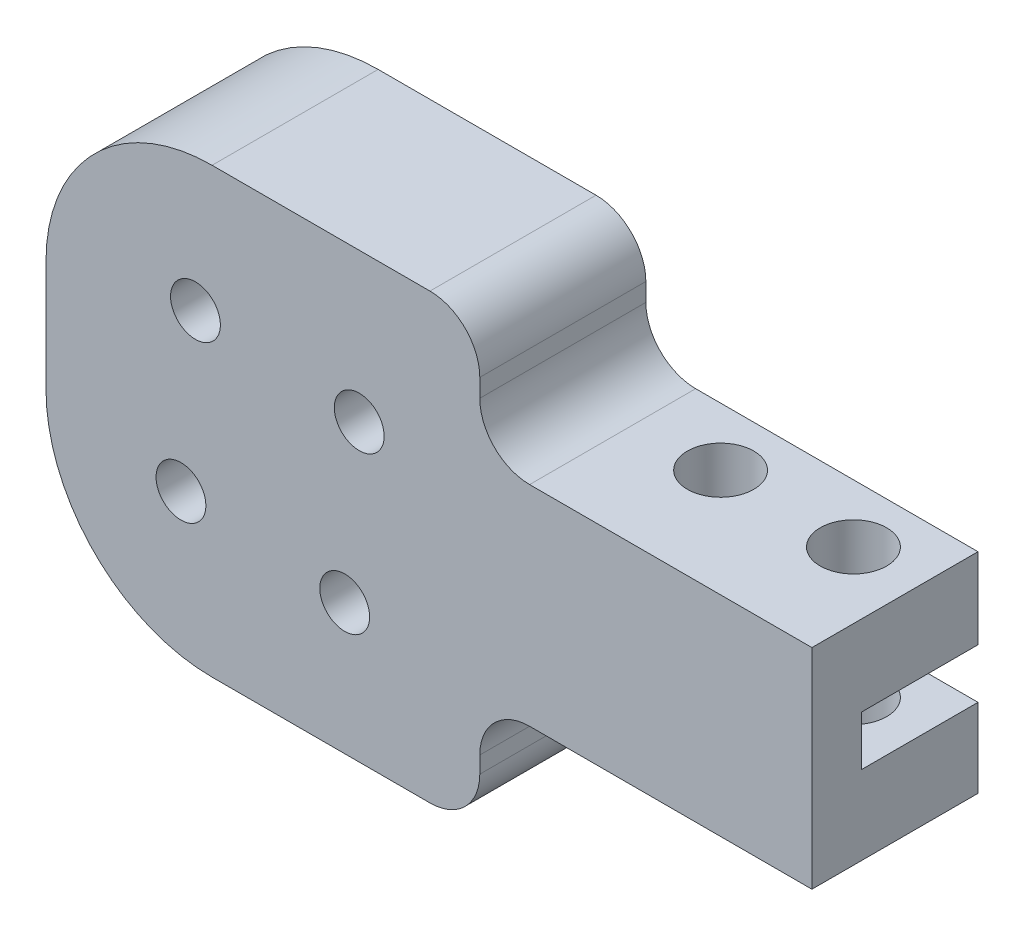
ISO-10303-21;
HEADER;
FILE_DESCRIPTION(('STEP AP214'),'2;1');
FILE_NAME('part.step','',(''),(''),'','','');
FILE_SCHEMA(('AUTOMOTIVE_DESIGN { 1 0 10303 214 1 1 1 1 }'));
ENDSEC;
DATA;
#1=APPLICATION_CONTEXT('core data for automotive mechanical design processes');
#2=APPLICATION_PROTOCOL_DEFINITION('international standard','automotive_design',2000,#1);
#3=PRODUCT_CONTEXT('',#1,'mechanical');
#4=PRODUCT('Part','Part','',(#3));
#5=PRODUCT_RELATED_PRODUCT_CATEGORY('part','',(#4));
#6=PRODUCT_DEFINITION_FORMATION('','',#4);
#7=PRODUCT_DEFINITION_CONTEXT('part definition',#1,'design');
#8=PRODUCT_DEFINITION('design','',#6,#7);
#9=PRODUCT_DEFINITION_SHAPE('','',#8);
#10=(LENGTH_UNIT() NAMED_UNIT(*) SI_UNIT(.MILLI.,.METRE.));
#11=(NAMED_UNIT(*) PLANE_ANGLE_UNIT() SI_UNIT($,.RADIAN.));
#12=(NAMED_UNIT(*) SI_UNIT($,.STERADIAN.) SOLID_ANGLE_UNIT());
#13=UNCERTAINTY_MEASURE_WITH_UNIT(LENGTH_MEASURE(1.E-05),#10,'distance_accuracy_value','');
#14=(GEOMETRIC_REPRESENTATION_CONTEXT(3) GLOBAL_UNCERTAINTY_ASSIGNED_CONTEXT((#13)) GLOBAL_UNIT_ASSIGNED_CONTEXT((#10,
#11,#12)) REPRESENTATION_CONTEXT('',''));
#15=CARTESIAN_POINT('',(0.,0.,0.));
#16=DIRECTION('',(0.,0.,1.));
#17=DIRECTION('',(1.,0.,0.));
#18=AXIS2_PLACEMENT_3D('',#15,#16,#17);
#19=CARTESIAN_POINT('',(-18.393953773828,17.863079719373,10.));
#20=DIRECTION('',(0.,0.,1.));
#21=DIRECTION('',(1.,0.,0.));
#22=AXIS2_PLACEMENT_3D('',#19,#20,#21);
#23=PLANE('',#22);
#24=DIRECTION('',(0.,1.,0.));
#25=VECTOR('',#24,1.);
#26=CARTESIAN_POINT('',(-5.76742802912065,31.308600149238,10.));
#27=LINE('',#26,#25);
#28=CARTESIAN_POINT('',(-5.76742802912065,27.2181452100799,10.));
#29=VERTEX_POINT('',#28);
#30=CARTESIAN_POINT('',(-5.76742802912065,28.308600149238,10.));
#31=VERTEX_POINT('',#30);
#32=EDGE_CURVE('E173',#29,#31,#27,.T.);
#33=ORIENTED_EDGE('',*,*,#32,.T.);
#34=CARTESIAN_POINT('',(-8.76742802912065,28.308600149238,10.));
#35=DIRECTION('',(0.,0.,1.));
#36=DIRECTION('',(1.,0.,0.));
#37=AXIS2_PLACEMENT_3D('',#34,#35,#36);
#38=CIRCLE('',#37,3.);
#39=CARTESIAN_POINT('',(-8.76742802912065,31.308600149238,10.));
#40=VERTEX_POINT('',#39);
#41=EDGE_CURVE('E59',#31,#40,#38,.T.);
#42=ORIENTED_EDGE('',*,*,#41,.T.);
#43=DIRECTION('',(-1.,0.,0.));
#44=VECTOR('',#43,1.);
#45=CARTESIAN_POINT('',(31.8143135194191,31.308600149238,10.));
#46=LINE('',#45,#44);
#47=CARTESIAN_POINT('',(-21.8876521447464,31.308600149238,10.));
#48=VERTEX_POINT('',#47);
#49=EDGE_CURVE('E213',#40,#48,#46,.T.);
#50=ORIENTED_EDGE('',*,*,#49,.T.);
#51=CARTESIAN_POINT('',(-21.8876521447464,21.308600149238,10.));
#52=DIRECTION('',(0.,0.,1.));
#53=DIRECTION('',(1.,0.,0.));
#54=AXIS2_PLACEMENT_3D('',#51,#52,#53);
#55=CIRCLE('',#54,10.);
#56=CARTESIAN_POINT('',(-31.8876521447464,21.308600149238,10.));
#57=VERTEX_POINT('',#56);
#58=EDGE_CURVE('E245',#48,#57,#55,.T.);
#59=ORIENTED_EDGE('',*,*,#58,.T.);
#60=DIRECTION('',(0.,-1.,0.));
#61=VECTOR('',#60,1.);
#62=CARTESIAN_POINT('',(-31.8876521447464,-32.0234769643548,10.));
#63=LINE('',#62,#61);
#64=CARTESIAN_POINT('',(-31.8876521447464,14.6152842401668,10.));
#65=VERTEX_POINT('',#64);
#66=EDGE_CURVE('E210',#57,#65,#63,.T.);
#67=ORIENTED_EDGE('',*,*,#66,.T.);
#68=CARTESIAN_POINT('',(-21.8876521447464,14.6152842401668,10.));
#69=DIRECTION('',(0.,0.,1.));
#70=DIRECTION('',(1.,0.,0.));
#71=AXIS2_PLACEMENT_3D('',#68,#69,#70);
#72=CIRCLE('',#71,10.);
#73=CARTESIAN_POINT('',(-21.8876521447464,4.61528424016677,10.));
#74=VERTEX_POINT('',#73);
#75=EDGE_CURVE('E243',#65,#74,#72,.T.);
#76=ORIENTED_EDGE('',*,*,#75,.T.);
#77=DIRECTION('',(1.,0.,0.));
#78=VECTOR('',#77,1.);
#79=CARTESIAN_POINT('',(-41.6050737450036,4.61528424016678,10.));
#80=LINE('',#79,#78);
#81=CARTESIAN_POINT('',(-8.76742802912066,4.61528424016677,10.));
#82=VERTEX_POINT('',#81);
#83=EDGE_CURVE('E204',#74,#82,#80,.T.);
#84=ORIENTED_EDGE('',*,*,#83,.T.);
#85=CARTESIAN_POINT('',(-8.76742802912065,7.61528424016677,10.));
#86=DIRECTION('',(0.,0.,1.));
#87=DIRECTION('',(1.,0.,0.));
#88=AXIS2_PLACEMENT_3D('',#85,#86,#87);
#89=CIRCLE('',#88,3.);
#90=CARTESIAN_POINT('',(-5.76742802912065,7.61528424016677,10.));
#91=VERTEX_POINT('',#90);
#92=EDGE_CURVE('E267',#82,#91,#89,.T.);
#93=ORIENTED_EDGE('',*,*,#92,.T.);
#94=DIRECTION('',(0.,1.,0.));
#95=VECTOR('',#94,1.);
#96=CARTESIAN_POINT('',(-5.76742802912065,4.61528424016677,10.));
#97=LINE('',#96,#95);
#98=CARTESIAN_POINT('',(-5.76742802912065,8.61528424016676,10.));
#99=VERTEX_POINT('',#98);
#100=EDGE_CURVE('E329',#91,#99,#97,.T.);
#101=ORIENTED_EDGE('',*,*,#100,.T.);
#102=CARTESIAN_POINT('',(-2.76742802912065,8.61528424016677,10.));
#103=DIRECTION('',(0.,0.,1.));
#104=DIRECTION('',(1.,0.,0.));
#105=AXIS2_PLACEMENT_3D('',#102,#103,#104);
#106=CIRCLE('',#105,3.);
#107=CARTESIAN_POINT('',(-2.76742802912065,11.6152842401668,10.));
#108=VERTEX_POINT('',#107);
#109=EDGE_CURVE('E274',#99,#108,#106,.F.);
#110=ORIENTED_EDGE('',*,*,#109,.T.);
#111=DIRECTION('',(1.,0.,0.));
#112=VECTOR('',#111,1.);
#113=CARTESIAN_POINT('',(14.2325719708793,11.6152842401668,10.));
#114=LINE('',#113,#112);
#115=CARTESIAN_POINT('',(14.2325719708793,11.6152842401668,10.));
#116=VERTEX_POINT('',#115);
#117=EDGE_CURVE('E332',#108,#116,#114,.T.);
#118=ORIENTED_EDGE('',*,*,#117,.T.);
#119=DIRECTION('',(0.,-1.,0.));
#120=VECTOR('',#119,1.);
#121=CARTESIAN_POINT('',(14.2325719708794,40.0528054621105,10.));
#122=LINE('',#121,#120);
#123=CARTESIAN_POINT('',(14.2325719708794,24.2181452100799,10.));
#124=VERTEX_POINT('',#123);
#125=EDGE_CURVE('E189',#124,#116,#122,.T.);
#126=ORIENTED_EDGE('',*,*,#125,.F.);
#127=DIRECTION('',(-1.,0.,0.));
#128=VECTOR('',#127,1.);
#129=CARTESIAN_POINT('',(14.2325719708793,24.2181452100799,10.));
#130=LINE('',#129,#128);
#131=CARTESIAN_POINT('',(-2.76742802912065,24.2181452100799,10.));
#132=VERTEX_POINT('',#131);
#133=EDGE_CURVE('E168',#124,#132,#130,.T.);
#134=ORIENTED_EDGE('',*,*,#133,.T.);
#135=CARTESIAN_POINT('',(-2.76742802912065,27.2181452100799,10.));
#136=DIRECTION('',(0.,0.,1.));
#137=DIRECTION('',(1.,0.,0.));
#138=AXIS2_PLACEMENT_3D('',#135,#136,#137);
#139=CIRCLE('',#138,3.);
#140=EDGE_CURVE('E11',#132,#29,#139,.F.);
#141=ORIENTED_EDGE('',*,*,#140,.T.);
#142=EDGE_LOOP('',(#33,#42,#50,#59,#67,#76,#84,#93,#101,#110,#118,#126,#134,#141));
#143=FACE_BOUND('',#142,.T.);
#144=CARTESIAN_POINT('',(-23.7611387856573,13.3693813484546,10.));
#145=DIRECTION('',(0.,0.,1.));
#146=DIRECTION('',(1.,0.,0.));
#147=AXIS2_PLACEMENT_3D('',#144,#145,#146);
#148=CIRCLE('',#147,1.5);
#149=CARTESIAN_POINT('',(-22.2611387856573,13.3693813484546,10.));
#150=VERTEX_POINT('',#149);
#151=EDGE_CURVE('E313',#150,#150,#148,.T.);
#152=ORIENTED_EDGE('',*,*,#151,.F.);
#153=EDGE_LOOP('',(#152));
#154=FACE_BOUND('',#153,.T.);
#155=CARTESIAN_POINT('',(-13.9002554029095,12.4958947075437,10.));
#156=DIRECTION('',(0.,0.,1.));
#157=DIRECTION('',(1.,0.,0.));
#158=AXIS2_PLACEMENT_3D('',#155,#156,#157);
#159=CIRCLE('',#158,1.5);
#160=CARTESIAN_POINT('',(-12.4002554029095,12.4958947075437,10.));
#161=VERTEX_POINT('',#160);
#162=EDGE_CURVE('E319',#161,#161,#159,.T.);
#163=ORIENTED_EDGE('',*,*,#162,.F.);
#164=EDGE_LOOP('',(#163));
#165=FACE_BOUND('',#164,.T.);
#166=CARTESIAN_POINT('',(-13.0267687619987,22.3567780902914,10.));
#167=DIRECTION('',(0.,0.,1.));
#168=DIRECTION('',(1.,0.,0.));
#169=AXIS2_PLACEMENT_3D('',#166,#167,#168);
#170=CIRCLE('',#169,1.5);
#171=CARTESIAN_POINT('',(-11.5267687619987,22.3567780902914,10.));
#172=VERTEX_POINT('',#171);
#173=EDGE_CURVE('E325',#172,#172,#170,.T.);
#174=ORIENTED_EDGE('',*,*,#173,.F.);
#175=EDGE_LOOP('',(#174));
#176=FACE_BOUND('',#175,.T.);
#177=CARTESIAN_POINT('',(-22.8876521447464,23.2302647312023,10.));
#178=DIRECTION('',(0.,0.,1.));
#179=DIRECTION('',(1.,0.,0.));
#180=AXIS2_PLACEMENT_3D('',#177,#178,#179);
#181=CIRCLE('',#180,1.5);
#182=CARTESIAN_POINT('',(-21.3876521447464,23.2302647312023,10.));
#183=VERTEX_POINT('',#182);
#184=EDGE_CURVE('E194',#183,#183,#181,.T.);
#185=ORIENTED_EDGE('',*,*,#184,.F.);
#186=EDGE_LOOP('',(#185));
#187=FACE_BOUND('',#186,.T.);
#188=ADVANCED_FACE('F34',(#143,#154,#165,#176,#187),#23,.T.);
#189=CARTESIAN_POINT('',(-18.393953773828,17.863079719373,0.));
#190=DIRECTION('',(0.,0.,1.));
#191=DIRECTION('',(1.,0.,0.));
#192=AXIS2_PLACEMENT_3D('',#189,#190,#191);
#193=PLANE('',#192);
#194=DIRECTION('',(1.,0.,0.));
#195=VECTOR('',#194,1.);
#196=CARTESIAN_POINT('',(-18.393953773828,31.308600149238,0.));
#197=LINE('',#196,#195);
#198=CARTESIAN_POINT('',(-21.8876521447464,31.308600149238,0.));
#199=VERTEX_POINT('',#198);
#200=CARTESIAN_POINT('',(-8.76742802912065,31.308600149238,0.));
#201=VERTEX_POINT('',#200);
#202=EDGE_CURVE('E236',#199,#201,#197,.T.);
#203=ORIENTED_EDGE('',*,*,#202,.T.);
#204=CARTESIAN_POINT('',(-8.76742802912065,28.308600149238,0.));
#205=DIRECTION('',(0.,0.,1.));
#206=DIRECTION('',(1.,0.,0.));
#207=AXIS2_PLACEMENT_3D('',#204,#205,#206);
#208=CIRCLE('',#207,3.);
#209=CARTESIAN_POINT('',(-5.76742802912065,28.308600149238,0.));
#210=VERTEX_POINT('',#209);
#211=EDGE_CURVE('E51',#201,#210,#208,.F.);
#212=ORIENTED_EDGE('',*,*,#211,.T.);
#213=DIRECTION('',(0.,1.,0.));
#214=VECTOR('',#213,1.);
#215=CARTESIAN_POINT('',(-5.76742802912065,31.308600149238,0.));
#216=LINE('',#215,#214);
#217=CARTESIAN_POINT('',(-5.76742802912065,27.2181452100799,0.));
#218=VERTEX_POINT('',#217);
#219=EDGE_CURVE('E182',#218,#210,#216,.T.);
#220=ORIENTED_EDGE('',*,*,#219,.F.);
#221=CARTESIAN_POINT('',(-2.76742802912065,27.2181452100799,0.));
#222=DIRECTION('',(0.,0.,1.));
#223=DIRECTION('',(1.,0.,0.));
#224=AXIS2_PLACEMENT_3D('',#221,#222,#223);
#225=CIRCLE('',#224,3.);
#226=CARTESIAN_POINT('',(-2.76742802912065,24.2181452100799,0.));
#227=VERTEX_POINT('',#226);
#228=EDGE_CURVE('E43',#218,#227,#225,.T.);
#229=ORIENTED_EDGE('',*,*,#228,.T.);
#230=DIRECTION('',(-1.,0.,0.));
#231=VECTOR('',#230,1.);
#232=CARTESIAN_POINT('',(14.2325719708793,24.2181452100799,0.));
#233=LINE('',#232,#231);
#234=CARTESIAN_POINT('',(14.2325719708793,24.2181452100799,0.));
#235=VERTEX_POINT('',#234);
#236=EDGE_CURVE('E165',#235,#227,#233,.T.);
#237=ORIENTED_EDGE('',*,*,#236,.F.);
#238=DIRECTION('',(0.,-1.,0.));
#239=VECTOR('',#238,1.);
#240=CARTESIAN_POINT('',(14.2325719708794,40.0528054621105,0.));
#241=LINE('',#240,#239);
#242=CARTESIAN_POINT('',(14.2325719708793,19.363079719373,0.));
#243=VERTEX_POINT('',#242);
#244=EDGE_CURVE('E179',#235,#243,#241,.T.);
#245=ORIENTED_EDGE('',*,*,#244,.T.);
#246=DIRECTION('',(1.,0.,0.));
#247=VECTOR('',#246,1.);
#248=CARTESIAN_POINT('',(-13.665602101554,19.363079719373,0.));
#249=LINE('',#248,#247);
#250=CARTESIAN_POINT('',(-8.50709380718538,19.363079719373,0.));
#251=VERTEX_POINT('',#250);
#252=EDGE_CURVE('E217',#251,#243,#249,.T.);
#253=ORIENTED_EDGE('',*,*,#252,.F.);
#254=CARTESIAN_POINT('',(-18.393953773828,17.863079719373,0.));
#255=DIRECTION('',(0.,0.,-1.));
#256=DIRECTION('',(-1.,0.,0.));
#257=AXIS2_PLACEMENT_3D('',#254,#255,#256);
#258=CIRCLE('',#257,10.);
#259=CARTESIAN_POINT('',(-8.50709380718537,16.363079719373,0.));
#260=VERTEX_POINT('',#259);
#261=EDGE_CURVE('E232',#260,#251,#258,.T.);
#262=ORIENTED_EDGE('',*,*,#261,.F.);
#263=DIRECTION('',(-1.,0.,0.));
#264=VECTOR('',#263,1.);
#265=CARTESIAN_POINT('',(-13.665602101554,16.363079719373,0.));
#266=LINE('',#265,#264);
#267=CARTESIAN_POINT('',(14.2325719708793,16.363079719373,0.));
#268=VERTEX_POINT('',#267);
#269=EDGE_CURVE('E222',#268,#260,#266,.T.);
#270=ORIENTED_EDGE('',*,*,#269,.F.);
#271=CARTESIAN_POINT('',(14.2325719708793,11.6152842401668,0.));
#272=VERTEX_POINT('',#271);
#273=EDGE_CURVE('E190',#268,#272,#241,.T.);
#274=ORIENTED_EDGE('',*,*,#273,.T.);
#275=DIRECTION('',(1.,0.,0.));
#276=VECTOR('',#275,1.);
#277=CARTESIAN_POINT('',(14.2325719708793,11.6152842401668,0.));
#278=LINE('',#277,#276);
#279=CARTESIAN_POINT('',(-2.76742802912065,11.6152842401668,0.));
#280=VERTEX_POINT('',#279);
#281=EDGE_CURVE('E333',#280,#272,#278,.T.);
#282=ORIENTED_EDGE('',*,*,#281,.F.);
#283=CARTESIAN_POINT('',(-2.76742802912065,8.61528424016677,0.));
#284=DIRECTION('',(0.,0.,1.));
#285=DIRECTION('',(1.,0.,0.));
#286=AXIS2_PLACEMENT_3D('',#283,#284,#285);
#287=CIRCLE('',#286,3.);
#288=CARTESIAN_POINT('',(-5.76742802912065,8.61528424016676,0.));
#289=VERTEX_POINT('',#288);
#290=EDGE_CURVE('E272',#280,#289,#287,.T.);
#291=ORIENTED_EDGE('',*,*,#290,.T.);
#292=DIRECTION('',(0.,1.,0.));
#293=VECTOR('',#292,1.);
#294=CARTESIAN_POINT('',(-5.76742802912065,4.61528424016677,0.));
#295=LINE('',#294,#293);
#296=CARTESIAN_POINT('',(-5.76742802912065,7.61528424016677,0.));
#297=VERTEX_POINT('',#296);
#298=EDGE_CURVE('E328',#297,#289,#295,.T.);
#299=ORIENTED_EDGE('',*,*,#298,.F.);
#300=CARTESIAN_POINT('',(-8.76742802912065,7.61528424016677,0.));
#301=DIRECTION('',(0.,0.,1.));
#302=DIRECTION('',(1.,0.,0.));
#303=AXIS2_PLACEMENT_3D('',#300,#301,#302);
#304=CIRCLE('',#303,3.);
#305=CARTESIAN_POINT('',(-8.76742802912066,4.61528424016677,0.));
#306=VERTEX_POINT('',#305);
#307=EDGE_CURVE('E263',#297,#306,#304,.F.);
#308=ORIENTED_EDGE('',*,*,#307,.T.);
#309=DIRECTION('',(1.,0.,0.));
#310=VECTOR('',#309,1.);
#311=CARTESIAN_POINT('',(-41.6050737450036,4.61528424016678,0.));
#312=LINE('',#311,#310);
#313=CARTESIAN_POINT('',(-21.8876521447464,4.61528424016677,0.));
#314=VERTEX_POINT('',#313);
#315=EDGE_CURVE('E203',#314,#306,#312,.T.);
#316=ORIENTED_EDGE('',*,*,#315,.F.);
#317=CARTESIAN_POINT('',(-21.8876521447464,14.6152842401668,0.));
#318=DIRECTION('',(0.,0.,1.));
#319=DIRECTION('',(1.,0.,0.));
#320=AXIS2_PLACEMENT_3D('',#317,#318,#319);
#321=CIRCLE('',#320,10.);
#322=CARTESIAN_POINT('',(-31.8876521447464,14.6152842401668,0.));
#323=VERTEX_POINT('',#322);
#324=EDGE_CURVE('E252',#314,#323,#321,.F.);
#325=ORIENTED_EDGE('',*,*,#324,.T.);
#326=DIRECTION('',(0.,-1.,0.));
#327=VECTOR('',#326,1.);
#328=CARTESIAN_POINT('',(-31.8876521447464,-32.0234769643548,0.));
#329=LINE('',#328,#327);
#330=CARTESIAN_POINT('',(-31.8876521447464,21.308600149238,0.));
#331=VERTEX_POINT('',#330);
#332=EDGE_CURVE('E207',#331,#323,#329,.T.);
#333=ORIENTED_EDGE('',*,*,#332,.F.);
#334=CARTESIAN_POINT('',(-21.8876521447464,21.308600149238,0.));
#335=DIRECTION('',(0.,0.,1.));
#336=DIRECTION('',(1.,0.,0.));
#337=AXIS2_PLACEMENT_3D('',#334,#335,#336);
#338=CIRCLE('',#337,10.);
#339=EDGE_CURVE('E254',#331,#199,#338,.F.);
#340=ORIENTED_EDGE('',*,*,#339,.T.);
#341=EDGE_LOOP('',(#203,#212,#220,#229,#237,#245,#253,#262,#270,#274,#282,#291,#299,#308,#316,
#325,#333,#340));
#342=FACE_BOUND('',#341,.T.);
#343=ADVANCED_FACE('F177',(#342),#193,.F.);
#344=CARTESIAN_POINT('',(-18.393953773828,17.863079719373,7.));
#345=DIRECTION('',(0.,0.,-1.));
#346=DIRECTION('',(-1.,0.,0.));
#347=AXIS2_PLACEMENT_3D('',#344,#345,#346);
#348=PLANE('',#347);
#349=CARTESIAN_POINT('',(-23.7611387856573,13.3693813484546,7.));
#350=DIRECTION('',(0.,0.,-1.));
#351=DIRECTION('',(0.,-1.,0.));
#352=AXIS2_PLACEMENT_3D('',#349,#350,#351);
#353=CIRCLE('',#352,1.5);
#354=CARTESIAN_POINT('',(-23.7611387856573,11.8693813484546,7.));
#355=VERTEX_POINT('',#354);
#356=EDGE_CURVE('E172',#355,#355,#353,.T.);
#357=ORIENTED_EDGE('',*,*,#356,.F.);
#358=EDGE_LOOP('',(#357));
#359=FACE_BOUND('',#358,.T.);
#360=CARTESIAN_POINT('',(-13.9002554029095,12.4958947075437,7.));
#361=DIRECTION('',(0.,0.,-1.));
#362=DIRECTION('',(1.,0.,0.));
#363=AXIS2_PLACEMENT_3D('',#360,#361,#362);
#364=CIRCLE('',#363,1.5);
#365=CARTESIAN_POINT('',(-12.4002554029095,12.4958947075437,7.));
#366=VERTEX_POINT('',#365);
#367=EDGE_CURVE('E316',#366,#366,#364,.T.);
#368=ORIENTED_EDGE('',*,*,#367,.F.);
#369=EDGE_LOOP('',(#368));
#370=FACE_BOUND('',#369,.T.);
#371=CARTESIAN_POINT('',(-13.0267687619987,22.3567780902914,7.));
#372=DIRECTION('',(0.,0.,-1.));
#373=DIRECTION('',(0.,1.,0.));
#374=AXIS2_PLACEMENT_3D('',#371,#372,#373);
#375=CIRCLE('',#374,1.5);
#376=CARTESIAN_POINT('',(-13.0267687619987,23.8567780902914,7.));
#377=VERTEX_POINT('',#376);
#378=EDGE_CURVE('E322',#377,#377,#375,.T.);
#379=ORIENTED_EDGE('',*,*,#378,.F.);
#380=EDGE_LOOP('',(#379));
#381=FACE_BOUND('',#380,.T.);
#382=CARTESIAN_POINT('',(-22.8876521447464,23.2302647312023,7.));
#383=DIRECTION('',(0.,0.,-1.));
#384=DIRECTION('',(-1.,0.,0.));
#385=AXIS2_PLACEMENT_3D('',#382,#383,#384);
#386=CIRCLE('',#385,1.5);
#387=CARTESIAN_POINT('',(-24.3876521447464,23.2302647312023,7.));
#388=VERTEX_POINT('',#387);
#389=EDGE_CURVE('E342',#388,#388,#386,.T.);
#390=ORIENTED_EDGE('',*,*,#389,.F.);
#391=EDGE_LOOP('',(#390));
#392=FACE_BOUND('',#391,.T.);
#393=DIRECTION('',(1.,0.,0.));
#394=VECTOR('',#393,1.);
#395=CARTESIAN_POINT('',(-13.665602101554,19.363079719373,7.));
#396=LINE('',#395,#394);
#397=CARTESIAN_POINT('',(-8.50709380718538,19.363079719373,7.));
#398=VERTEX_POINT('',#397);
#399=CARTESIAN_POINT('',(14.2325719708793,19.363079719373,7.));
#400=VERTEX_POINT('',#399);
#401=EDGE_CURVE('E218',#398,#400,#396,.T.);
#402=ORIENTED_EDGE('',*,*,#401,.T.);
#403=DIRECTION('',(0.,-1.,0.));
#404=VECTOR('',#403,1.);
#405=CARTESIAN_POINT('',(14.2325719708793,17.863079719373,7.));
#406=LINE('',#405,#404);
#407=CARTESIAN_POINT('',(14.2325719708793,16.363079719373,7.));
#408=VERTEX_POINT('',#407);
#409=EDGE_CURVE('E198',#400,#408,#406,.T.);
#410=ORIENTED_EDGE('',*,*,#409,.T.);
#411=DIRECTION('',(-1.,0.,0.));
#412=VECTOR('',#411,1.);
#413=CARTESIAN_POINT('',(-13.665602101554,16.363079719373,7.));
#414=LINE('',#413,#412);
#415=CARTESIAN_POINT('',(-8.50709380718537,16.363079719373,7.));
#416=VERTEX_POINT('',#415);
#417=EDGE_CURVE('E221',#408,#416,#414,.T.);
#418=ORIENTED_EDGE('',*,*,#417,.T.);
#419=CARTESIAN_POINT('',(-18.393953773828,17.863079719373,7.));
#420=DIRECTION('',(0.,0.,-1.));
#421=DIRECTION('',(-1.,0.,0.));
#422=AXIS2_PLACEMENT_3D('',#419,#420,#421);
#423=CIRCLE('',#422,10.);
#424=EDGE_CURVE('E233',#416,#398,#423,.T.);
#425=ORIENTED_EDGE('',*,*,#424,.T.);
#426=EDGE_LOOP('',(#402,#410,#418,#425));
#427=FACE_BOUND('',#426,.T.);
#428=ADVANCED_FACE('F355',(#359,#370,#381,#392,#427),#348,.T.);
#429=CARTESIAN_POINT('',(-13.665602101554,16.363079719373,7.));
#430=DIRECTION('',(0.,-1.,0.));
#431=DIRECTION('',(1.,0.,0.));
#432=AXIS2_PLACEMENT_3D('',#429,#430,#431);
#433=PLANE('',#432);
#434=CARTESIAN_POINT('',(2.23257197087935,16.363079719373,3.5));
#435=DIRECTION('',(0.,-1.,0.));
#436=DIRECTION('',(1.,0.,0.));
#437=AXIS2_PLACEMENT_3D('',#434,#435,#436);
#438=CIRCLE('',#437,2.);
#439=CARTESIAN_POINT('',(4.23257197087935,16.363079719373,3.5));
#440=VERTEX_POINT('',#439);
#441=EDGE_CURVE('E296',#440,#440,#438,.T.);
#442=ORIENTED_EDGE('',*,*,#441,.T.);
#443=EDGE_LOOP('',(#442));
#444=FACE_BOUND('',#443,.T.);
#445=CARTESIAN_POINT('',(10.2325719708793,16.363079719373,3.5));
#446=DIRECTION('',(0.,-1.,0.));
#447=DIRECTION('',(1.,0.,0.));
#448=AXIS2_PLACEMENT_3D('',#445,#446,#447);
#449=CIRCLE('',#448,2.);
#450=CARTESIAN_POINT('',(12.2325719708793,16.363079719373,3.5));
#451=VERTEX_POINT('',#450);
#452=EDGE_CURVE('E183',#451,#451,#449,.T.);
#453=ORIENTED_EDGE('',*,*,#452,.T.);
#454=EDGE_LOOP('',(#453));
#455=FACE_BOUND('',#454,.T.);
#456=DIRECTION('',(0.,0.,1.));
#457=VECTOR('',#456,1.);
#458=CARTESIAN_POINT('',(14.2325719708793,16.363079719373,7.));
#459=LINE('',#458,#457);
#460=EDGE_CURVE('E201',#268,#408,#459,.T.);
#461=ORIENTED_EDGE('',*,*,#460,.F.);
#462=ORIENTED_EDGE('',*,*,#269,.T.);
#463=DIRECTION('',(0.,0.,-1.));
#464=VECTOR('',#463,1.);
#465=CARTESIAN_POINT('',(-8.50709380718537,16.363079719373,7.));
#466=LINE('',#465,#464);
#467=EDGE_CURVE('E229',#416,#260,#466,.T.);
#468=ORIENTED_EDGE('',*,*,#467,.F.);
#469=ORIENTED_EDGE('',*,*,#417,.F.);
#470=EDGE_LOOP('',(#461,#462,#468,#469));
#471=FACE_BOUND('',#470,.T.);
#472=ADVANCED_FACE('F431',(#444,#455,#471),#433,.F.);
#473=CARTESIAN_POINT('',(-13.665602101554,19.363079719373,7.));
#474=DIRECTION('',(0.,1.,0.));
#475=DIRECTION('',(0.,0.,1.));
#476=AXIS2_PLACEMENT_3D('',#473,#474,#475);
#477=PLANE('',#476);
#478=CARTESIAN_POINT('',(2.23257197087935,19.363079719373,3.5));
#479=DIRECTION('',(0.,1.,0.));
#480=DIRECTION('',(0.,0.,1.));
#481=AXIS2_PLACEMENT_3D('',#478,#479,#480);
#482=CIRCLE('',#481,2.);
#483=CARTESIAN_POINT('',(2.23257197087935,19.363079719373,5.5));
#484=VERTEX_POINT('',#483);
#485=EDGE_CURVE('E301',#484,#484,#482,.T.);
#486=ORIENTED_EDGE('',*,*,#485,.T.);
#487=EDGE_LOOP('',(#486));
#488=FACE_BOUND('',#487,.T.);
#489=CARTESIAN_POINT('',(10.2325719708793,19.363079719373,3.5));
#490=DIRECTION('',(0.,1.,0.));
#491=DIRECTION('',(0.,0.,1.));
#492=AXIS2_PLACEMENT_3D('',#489,#490,#491);
#493=CIRCLE('',#492,2.);
#494=CARTESIAN_POINT('',(10.2325719708793,19.363079719373,5.5));
#495=VERTEX_POINT('',#494);
#496=EDGE_CURVE('E289',#495,#495,#493,.T.);
#497=ORIENTED_EDGE('',*,*,#496,.T.);
#498=EDGE_LOOP('',(#497));
#499=FACE_BOUND('',#498,.T.);
#500=DIRECTION('',(0.,0.,-1.));
#501=VECTOR('',#500,1.);
#502=CARTESIAN_POINT('',(14.2325719708793,19.363079719373,7.));
#503=LINE('',#502,#501);
#504=EDGE_CURVE('E187',#400,#243,#503,.T.);
#505=ORIENTED_EDGE('',*,*,#504,.F.);
#506=ORIENTED_EDGE('',*,*,#401,.F.);
#507=DIRECTION('',(0.,0.,-1.));
#508=VECTOR('',#507,1.);
#509=CARTESIAN_POINT('',(-8.50709380718538,19.363079719373,7.));
#510=LINE('',#509,#508);
#511=EDGE_CURVE('E224',#251,#398,#510,.F.);
#512=ORIENTED_EDGE('',*,*,#511,.F.);
#513=ORIENTED_EDGE('',*,*,#252,.T.);
#514=EDGE_LOOP('',(#505,#506,#512,#513));
#515=FACE_BOUND('',#514,.T.);
#516=ADVANCED_FACE('F437',(#488,#499,#515),#477,.F.);
#517=CARTESIAN_POINT('',(31.8143135194191,31.308600149238,10.));
#518=DIRECTION('',(0.,-1.,0.));
#519=DIRECTION('',(0.,0.,-1.));
#520=AXIS2_PLACEMENT_3D('',#517,#518,#519);
#521=PLANE('',#520);
#522=ORIENTED_EDGE('',*,*,#49,.F.);
#523=DIRECTION('',(0.,0.,-1.));
#524=VECTOR('',#523,1.);
#525=CARTESIAN_POINT('',(-8.76742802912065,31.308600149238,10.));
#526=LINE('',#525,#524);
#527=EDGE_CURVE('E283',#40,#201,#526,.T.);
#528=ORIENTED_EDGE('',*,*,#527,.T.);
#529=ORIENTED_EDGE('',*,*,#202,.F.);
#530=DIRECTION('',(0.,0.,1.));
#531=VECTOR('',#530,1.);
#532=CARTESIAN_POINT('',(-21.8876521447464,31.308600149238,10.));
#533=LINE('',#532,#531);
#534=EDGE_CURVE('E240',#199,#48,#533,.T.);
#535=ORIENTED_EDGE('',*,*,#534,.T.);
#536=EDGE_LOOP('',(#522,#528,#529,#535));
#537=FACE_BOUND('',#536,.T.);
#538=ADVANCED_FACE('F397',(#537),#521,.F.);
#539=CARTESIAN_POINT('',(-41.6050737450036,4.61528424016678,10.));
#540=DIRECTION('',(0.,1.,0.));
#541=DIRECTION('',(-1.,0.,0.));
#542=AXIS2_PLACEMENT_3D('',#539,#540,#541);
#543=PLANE('',#542);
#544=ORIENTED_EDGE('',*,*,#315,.T.);
#545=DIRECTION('',(0.,0.,-1.));
#546=VECTOR('',#545,1.);
#547=CARTESIAN_POINT('',(-8.76742802912066,4.61528424016677,10.));
#548=LINE('',#547,#546);
#549=EDGE_CURVE('E265',#306,#82,#548,.F.);
#550=ORIENTED_EDGE('',*,*,#549,.T.);
#551=ORIENTED_EDGE('',*,*,#83,.F.);
#552=DIRECTION('',(0.,0.,1.));
#553=VECTOR('',#552,1.);
#554=CARTESIAN_POINT('',(-21.8876521447464,4.61528424016677,10.));
#555=LINE('',#554,#553);
#556=EDGE_CURVE('E256',#74,#314,#555,.F.);
#557=ORIENTED_EDGE('',*,*,#556,.T.);
#558=EDGE_LOOP('',(#544,#550,#551,#557));
#559=FACE_BOUND('',#558,.T.);
#560=ADVANCED_FACE('F412',(#559),#543,.F.);
#561=CARTESIAN_POINT('',(-18.393953773828,17.863079719373,7.));
#562=DIRECTION('',(0.,0.,-1.));
#563=DIRECTION('',(-1.,0.,0.));
#564=AXIS2_PLACEMENT_3D('',#561,#562,#563);
#565=CYLINDRICAL_SURFACE('',#564,10.);
#566=ORIENTED_EDGE('',*,*,#424,.F.);
#567=ORIENTED_EDGE('',*,*,#467,.T.);
#568=ORIENTED_EDGE('',*,*,#261,.T.);
#569=ORIENTED_EDGE('',*,*,#511,.T.);
#570=EDGE_LOOP('',(#566,#567,#568,#569));
#571=FACE_BOUND('',#570,.T.);
#572=ADVANCED_FACE('F359',(#571),#565,.F.);
#573=CARTESIAN_POINT('',(-31.8876521447464,-32.0234769643548,10.));
#574=DIRECTION('',(1.,0.,0.));
#575=DIRECTION('',(0.,0.,-1.));
#576=AXIS2_PLACEMENT_3D('',#573,#574,#575);
#577=PLANE('',#576);
#578=ORIENTED_EDGE('',*,*,#66,.F.);
#579=DIRECTION('',(0.,0.,1.));
#580=VECTOR('',#579,1.);
#581=CARTESIAN_POINT('',(-31.8876521447464,21.308600149238,10.));
#582=LINE('',#581,#580);
#583=EDGE_CURVE('E250',#57,#331,#582,.F.);
#584=ORIENTED_EDGE('',*,*,#583,.T.);
#585=ORIENTED_EDGE('',*,*,#332,.T.);
#586=DIRECTION('',(0.,0.,1.));
#587=VECTOR('',#586,1.);
#588=CARTESIAN_POINT('',(-31.8876521447464,14.6152842401668,10.));
#589=LINE('',#588,#587);
#590=EDGE_CURVE('E247',#323,#65,#589,.T.);
#591=ORIENTED_EDGE('',*,*,#590,.T.);
#592=EDGE_LOOP('',(#578,#584,#585,#591));
#593=FACE_BOUND('',#592,.T.);
#594=ADVANCED_FACE('F405',(#593),#577,.F.);
#595=CARTESIAN_POINT('',(14.2325719708794,40.0528054621105,10.));
#596=DIRECTION('',(1.,0.,0.));
#597=DIRECTION('',(0.,1.,0.));
#598=AXIS2_PLACEMENT_3D('',#595,#596,#597);
#599=PLANE('',#598);
#600=DIRECTION('',(0.,0.,-1.));
#601=VECTOR('',#600,1.);
#602=CARTESIAN_POINT('',(14.2325719708793,24.2181452100799,10.));
#603=LINE('',#602,#601);
#604=EDGE_CURVE('E162',#124,#235,#603,.T.);
#605=ORIENTED_EDGE('',*,*,#604,.F.);
#606=ORIENTED_EDGE('',*,*,#125,.T.);
#607=DIRECTION('',(0.,0.,-1.));
#608=VECTOR('',#607,1.);
#609=CARTESIAN_POINT('',(14.2325719708793,11.6152842401668,10.));
#610=LINE('',#609,#608);
#611=EDGE_CURVE('E336',#116,#272,#610,.T.);
#612=ORIENTED_EDGE('',*,*,#611,.T.);
#613=ORIENTED_EDGE('',*,*,#273,.F.);
#614=ORIENTED_EDGE('',*,*,#460,.T.);
#615=ORIENTED_EDGE('',*,*,#409,.F.);
#616=ORIENTED_EDGE('',*,*,#504,.T.);
#617=ORIENTED_EDGE('',*,*,#244,.F.);
#618=EDGE_LOOP('',(#605,#606,#612,#613,#614,#615,#616,#617));
#619=FACE_BOUND('',#618,.T.);
#620=ADVANCED_FACE('F185',(#619),#599,.T.);
#621=CARTESIAN_POINT('',(-22.8876521447464,23.2302647312023,17.));
#622=DIRECTION('',(0.,0.,-1.));
#623=DIRECTION('',(-1.,0.,0.));
#624=AXIS2_PLACEMENT_3D('',#621,#622,#623);
#625=CYLINDRICAL_SURFACE('',#624,1.5);
#626=ORIENTED_EDGE('',*,*,#184,.T.);
#627=EDGE_LOOP('',(#626));
#628=FACE_BOUND('',#627,.T.);
#629=ORIENTED_EDGE('',*,*,#389,.T.);
#630=EDGE_LOOP('',(#629));
#631=FACE_BOUND('',#630,.T.);
#632=ADVANCED_FACE('F347',(#628,#631),#625,.F.);
#633=CARTESIAN_POINT('',(-21.8876521447464,21.308600149238,10.));
#634=DIRECTION('',(0.,0.,1.));
#635=DIRECTION('',(1.,0.,0.));
#636=AXIS2_PLACEMENT_3D('',#633,#634,#635);
#637=CYLINDRICAL_SURFACE('',#636,10.);
#638=ORIENTED_EDGE('',*,*,#339,.F.);
#639=ORIENTED_EDGE('',*,*,#583,.F.);
#640=ORIENTED_EDGE('',*,*,#58,.F.);
#641=ORIENTED_EDGE('',*,*,#534,.F.);
#642=EDGE_LOOP('',(#638,#639,#640,#641));
#643=FACE_BOUND('',#642,.T.);
#644=ADVANCED_FACE('F362',(#643),#637,.T.);
#645=CARTESIAN_POINT('',(-21.8876521447464,14.6152842401668,10.));
#646=DIRECTION('',(0.,0.,1.));
#647=DIRECTION('',(1.,0.,0.));
#648=AXIS2_PLACEMENT_3D('',#645,#646,#647);
#649=CYLINDRICAL_SURFACE('',#648,10.);
#650=ORIENTED_EDGE('',*,*,#324,.F.);
#651=ORIENTED_EDGE('',*,*,#556,.F.);
#652=ORIENTED_EDGE('',*,*,#75,.F.);
#653=ORIENTED_EDGE('',*,*,#590,.F.);
#654=EDGE_LOOP('',(#650,#651,#652,#653));
#655=FACE_BOUND('',#654,.T.);
#656=ADVANCED_FACE('F365',(#655),#649,.T.);
#657=CARTESIAN_POINT('',(14.2325719708793,11.6152842401668,10.));
#658=DIRECTION('',(0.,1.,0.));
#659=DIRECTION('',(0.,0.,1.));
#660=AXIS2_PLACEMENT_3D('',#657,#658,#659);
#661=PLANE('',#660);
#662=CARTESIAN_POINT('',(2.23257197087935,11.6152842401668,3.5));
#663=DIRECTION('',(0.,-1.,0.));
#664=DIRECTION('',(0.,0.,-1.));
#665=AXIS2_PLACEMENT_3D('',#662,#663,#664);
#666=CIRCLE('',#665,2.);
#667=CARTESIAN_POINT('',(2.23257197087935,11.6152842401668,1.5));
#668=VERTEX_POINT('',#667);
#669=EDGE_CURVE('E673',#668,#668,#666,.T.);
#670=ORIENTED_EDGE('',*,*,#669,.F.);
#671=EDGE_LOOP('',(#670));
#672=FACE_BOUND('',#671,.T.);
#673=CARTESIAN_POINT('',(10.2325719708793,11.6152842401668,3.5));
#674=DIRECTION('',(0.,-1.,0.));
#675=DIRECTION('',(0.,0.,-1.));
#676=AXIS2_PLACEMENT_3D('',#673,#674,#675);
#677=CIRCLE('',#676,2.);
#678=CARTESIAN_POINT('',(10.2325719708793,11.6152842401668,1.5));
#679=VERTEX_POINT('',#678);
#680=EDGE_CURVE('E290',#679,#679,#677,.T.);
#681=ORIENTED_EDGE('',*,*,#680,.F.);
#682=EDGE_LOOP('',(#681));
#683=FACE_BOUND('',#682,.T.);
#684=ORIENTED_EDGE('',*,*,#117,.F.);
#685=DIRECTION('',(0.,0.,-1.));
#686=VECTOR('',#685,1.);
#687=CARTESIAN_POINT('',(-2.76742802912065,11.6152842401668,0.));
#688=LINE('',#687,#686);
#689=EDGE_CURVE('E269',#108,#280,#688,.T.);
#690=ORIENTED_EDGE('',*,*,#689,.T.);
#691=ORIENTED_EDGE('',*,*,#281,.T.);
#692=ORIENTED_EDGE('',*,*,#611,.F.);
#693=EDGE_LOOP('',(#684,#690,#691,#692));
#694=FACE_BOUND('',#693,.T.);
#695=ADVANCED_FACE('F369',(#672,#683,#694),#661,.F.);
#696=CARTESIAN_POINT('',(-5.76742802912065,4.61528424016677,10.));
#697=DIRECTION('',(-1.,0.,0.));
#698=DIRECTION('',(0.,0.,1.));
#699=AXIS2_PLACEMENT_3D('',#696,#697,#698);
#700=PLANE('',#699);
#701=ORIENTED_EDGE('',*,*,#100,.F.);
#702=DIRECTION('',(0.,0.,-1.));
#703=VECTOR('',#702,1.);
#704=CARTESIAN_POINT('',(-5.76742802912065,7.61528424016677,10.));
#705=LINE('',#704,#703);
#706=EDGE_CURVE('E260',#91,#297,#705,.T.);
#707=ORIENTED_EDGE('',*,*,#706,.T.);
#708=ORIENTED_EDGE('',*,*,#298,.T.);
#709=DIRECTION('',(0.,0.,-1.));
#710=VECTOR('',#709,1.);
#711=CARTESIAN_POINT('',(-5.76742802912065,8.61528424016677,10.));
#712=LINE('',#711,#710);
#713=EDGE_CURVE('E258',#289,#99,#712,.F.);
#714=ORIENTED_EDGE('',*,*,#713,.T.);
#715=EDGE_LOOP('',(#701,#707,#708,#714));
#716=FACE_BOUND('',#715,.T.);
#717=ADVANCED_FACE('F375',(#716),#700,.F.);
#718=CARTESIAN_POINT('',(-8.76742802912065,7.61528424016677,10.));
#719=DIRECTION('',(0.,0.,-1.));
#720=DIRECTION('',(-1.,0.,0.));
#721=AXIS2_PLACEMENT_3D('',#718,#719,#720);
#722=CYLINDRICAL_SURFACE('',#721,3.);
#723=ORIENTED_EDGE('',*,*,#92,.F.);
#724=ORIENTED_EDGE('',*,*,#549,.F.);
#725=ORIENTED_EDGE('',*,*,#307,.F.);
#726=ORIENTED_EDGE('',*,*,#706,.F.);
#727=EDGE_LOOP('',(#723,#724,#725,#726));
#728=FACE_BOUND('',#727,.T.);
#729=ADVANCED_FACE('F371',(#728),#722,.T.);
#730=CARTESIAN_POINT('',(-2.76742802912065,8.61528424016677,10.));
#731=DIRECTION('',(0.,0.,1.));
#732=DIRECTION('',(1.,0.,0.));
#733=AXIS2_PLACEMENT_3D('',#730,#731,#732);
#734=CYLINDRICAL_SURFACE('',#733,3.);
#735=ORIENTED_EDGE('',*,*,#109,.F.);
#736=ORIENTED_EDGE('',*,*,#713,.F.);
#737=ORIENTED_EDGE('',*,*,#290,.F.);
#738=ORIENTED_EDGE('',*,*,#689,.F.);
#739=EDGE_LOOP('',(#735,#736,#737,#738));
#740=FACE_BOUND('',#739,.T.);
#741=ADVANCED_FACE('F374',(#740),#734,.F.);
#742=CARTESIAN_POINT('',(-13.0267687619987,22.3567780902914,17.));
#743=DIRECTION('',(0.,0.,-1.));
#744=DIRECTION('',(-1.,0.,0.));
#745=AXIS2_PLACEMENT_3D('',#742,#743,#744);
#746=CYLINDRICAL_SURFACE('',#745,1.5);
#747=ORIENTED_EDGE('',*,*,#173,.T.);
#748=EDGE_LOOP('',(#747));
#749=FACE_BOUND('',#748,.T.);
#750=ORIENTED_EDGE('',*,*,#378,.T.);
#751=EDGE_LOOP('',(#750));
#752=FACE_BOUND('',#751,.T.);
#753=ADVANCED_FACE('F378',(#749,#752),#746,.F.);
#754=CARTESIAN_POINT('',(-13.9002554029095,12.4958947075437,17.));
#755=DIRECTION('',(0.,0.,-1.));
#756=DIRECTION('',(-1.,0.,0.));
#757=AXIS2_PLACEMENT_3D('',#754,#755,#756);
#758=CYLINDRICAL_SURFACE('',#757,1.5);
#759=ORIENTED_EDGE('',*,*,#162,.T.);
#760=EDGE_LOOP('',(#759));
#761=FACE_BOUND('',#760,.T.);
#762=ORIENTED_EDGE('',*,*,#367,.T.);
#763=EDGE_LOOP('',(#762));
#764=FACE_BOUND('',#763,.T.);
#765=ADVANCED_FACE('F584',(#761,#764),#758,.F.);
#766=CARTESIAN_POINT('',(-23.7611387856573,13.3693813484546,17.));
#767=DIRECTION('',(0.,0.,-1.));
#768=DIRECTION('',(-1.,0.,0.));
#769=AXIS2_PLACEMENT_3D('',#766,#767,#768);
#770=CYLINDRICAL_SURFACE('',#769,1.5);
#771=ORIENTED_EDGE('',*,*,#151,.T.);
#772=EDGE_LOOP('',(#771));
#773=FACE_BOUND('',#772,.T.);
#774=ORIENTED_EDGE('',*,*,#356,.T.);
#775=EDGE_LOOP('',(#774));
#776=FACE_BOUND('',#775,.T.);
#777=ADVANCED_FACE('F500',(#773,#776),#770,.F.);
#778=CARTESIAN_POINT('',(-5.76742802912065,31.308600149238,10.));
#779=DIRECTION('',(-1.,0.,0.));
#780=DIRECTION('',(0.,-1.,0.));
#781=AXIS2_PLACEMENT_3D('',#778,#779,#780);
#782=PLANE('',#781);
#783=ORIENTED_EDGE('',*,*,#32,.F.);
#784=DIRECTION('',(0.,0.,-1.));
#785=VECTOR('',#784,1.);
#786=CARTESIAN_POINT('',(-5.76742802912065,27.2181452100799,0.));
#787=LINE('',#786,#785);
#788=EDGE_CURVE('E278',#29,#218,#787,.T.);
#789=ORIENTED_EDGE('',*,*,#788,.T.);
#790=ORIENTED_EDGE('',*,*,#219,.T.);
#791=DIRECTION('',(0.,0.,-1.));
#792=VECTOR('',#791,1.);
#793=CARTESIAN_POINT('',(-5.76742802912065,28.308600149238,10.));
#794=LINE('',#793,#792);
#795=EDGE_CURVE('E276',#210,#31,#794,.F.);
#796=ORIENTED_EDGE('',*,*,#795,.T.);
#797=EDGE_LOOP('',(#783,#789,#790,#796));
#798=FACE_BOUND('',#797,.T.);
#799=ADVANCED_FACE('F388',(#798),#782,.F.);
#800=CARTESIAN_POINT('',(14.2325719708793,24.2181452100799,10.));
#801=DIRECTION('',(0.,-1.,0.));
#802=DIRECTION('',(0.,0.,-1.));
#803=AXIS2_PLACEMENT_3D('',#800,#801,#802);
#804=PLANE('',#803);
#805=CARTESIAN_POINT('',(2.23257197087935,24.2181452100799,3.5));
#806=DIRECTION('',(0.,-1.,0.));
#807=DIRECTION('',(0.,0.,-1.));
#808=AXIS2_PLACEMENT_3D('',#805,#806,#807);
#809=CIRCLE('',#808,2.);
#810=CARTESIAN_POINT('',(2.23257197087935,24.2181452100799,1.5));
#811=VERTEX_POINT('',#810);
#812=EDGE_CURVE('E38',#811,#811,#809,.T.);
#813=ORIENTED_EDGE('',*,*,#812,.T.);
#814=EDGE_LOOP('',(#813));
#815=FACE_BOUND('',#814,.T.);
#816=CARTESIAN_POINT('',(10.2325719708793,24.2181452100799,3.5));
#817=DIRECTION('',(0.,-1.,0.));
#818=DIRECTION('',(0.,0.,-1.));
#819=AXIS2_PLACEMENT_3D('',#816,#817,#818);
#820=CIRCLE('',#819,2.);
#821=CARTESIAN_POINT('',(10.2325719708793,24.2181452100799,1.5));
#822=VERTEX_POINT('',#821);
#823=EDGE_CURVE('E287',#822,#822,#820,.T.);
#824=ORIENTED_EDGE('',*,*,#823,.T.);
#825=EDGE_LOOP('',(#824));
#826=FACE_BOUND('',#825,.T.);
#827=ORIENTED_EDGE('',*,*,#236,.T.);
#828=DIRECTION('',(0.,0.,-1.));
#829=VECTOR('',#828,1.);
#830=CARTESIAN_POINT('',(-2.76742802912065,24.2181452100799,10.));
#831=LINE('',#830,#829);
#832=EDGE_CURVE('E281',#227,#132,#831,.F.);
#833=ORIENTED_EDGE('',*,*,#832,.T.);
#834=ORIENTED_EDGE('',*,*,#133,.F.);
#835=ORIENTED_EDGE('',*,*,#604,.T.);
#836=EDGE_LOOP('',(#827,#833,#834,#835));
#837=FACE_BOUND('',#836,.T.);
#838=ADVANCED_FACE('F164',(#815,#826,#837),#804,.F.);
#839=CARTESIAN_POINT('',(-2.76742802912065,27.2181452100799,10.));
#840=DIRECTION('',(0.,0.,1.));
#841=DIRECTION('',(1.,0.,0.));
#842=AXIS2_PLACEMENT_3D('',#839,#840,#841);
#843=CYLINDRICAL_SURFACE('',#842,3.);
#844=ORIENTED_EDGE('',*,*,#140,.F.);
#845=ORIENTED_EDGE('',*,*,#832,.F.);
#846=ORIENTED_EDGE('',*,*,#228,.F.);
#847=ORIENTED_EDGE('',*,*,#788,.F.);
#848=EDGE_LOOP('',(#844,#845,#846,#847));
#849=FACE_BOUND('',#848,.T.);
#850=ADVANCED_FACE('F380',(#849),#843,.F.);
#851=CARTESIAN_POINT('',(-8.76742802912065,28.308600149238,10.));
#852=DIRECTION('',(0.,0.,-1.));
#853=DIRECTION('',(-1.,0.,0.));
#854=AXIS2_PLACEMENT_3D('',#851,#852,#853);
#855=CYLINDRICAL_SURFACE('',#854,3.);
#856=ORIENTED_EDGE('',*,*,#41,.F.);
#857=ORIENTED_EDGE('',*,*,#795,.F.);
#858=ORIENTED_EDGE('',*,*,#211,.F.);
#859=ORIENTED_EDGE('',*,*,#527,.F.);
#860=EDGE_LOOP('',(#856,#857,#858,#859));
#861=FACE_BOUND('',#860,.T.);
#862=ADVANCED_FACE('F36',(#861),#855,.T.);
#863=CARTESIAN_POINT('',(10.2325719708793,31.6152842401668,3.5));
#864=DIRECTION('',(0.,-1.,0.));
#865=DIRECTION('',(0.,0.,-1.));
#866=AXIS2_PLACEMENT_3D('',#863,#864,#865);
#867=CYLINDRICAL_SURFACE('',#866,2.);
#868=ORIENTED_EDGE('',*,*,#823,.F.);
#869=EDGE_LOOP('',(#868));
#870=FACE_BOUND('',#869,.T.);
#871=ORIENTED_EDGE('',*,*,#496,.F.);
#872=EDGE_LOOP('',(#871));
#873=FACE_BOUND('',#872,.T.);
#874=ADVANCED_FACE('F387',(#870,#873),#867,.F.);
#875=ORIENTED_EDGE('',*,*,#680,.T.);
#876=EDGE_LOOP('',(#875));
#877=FACE_BOUND('',#876,.T.);
#878=ORIENTED_EDGE('',*,*,#452,.F.);
#879=EDGE_LOOP('',(#878));
#880=FACE_BOUND('',#879,.T.);
#881=ADVANCED_FACE('F523',(#877,#880),#867,.F.);
#882=CARTESIAN_POINT('',(2.23257197087935,31.6152842401668,3.5));
#883=DIRECTION('',(0.,-1.,0.));
#884=DIRECTION('',(0.,0.,-1.));
#885=AXIS2_PLACEMENT_3D('',#882,#883,#884);
#886=CYLINDRICAL_SURFACE('',#885,2.);
#887=ORIENTED_EDGE('',*,*,#812,.F.);
#888=EDGE_LOOP('',(#887));
#889=FACE_BOUND('',#888,.T.);
#890=ORIENTED_EDGE('',*,*,#485,.F.);
#891=EDGE_LOOP('',(#890));
#892=FACE_BOUND('',#891,.T.);
#893=ADVANCED_FACE('F533',(#889,#892),#886,.F.);
#894=ORIENTED_EDGE('',*,*,#669,.T.);
#895=EDGE_LOOP('',(#894));
#896=FACE_BOUND('',#895,.T.);
#897=ORIENTED_EDGE('',*,*,#441,.F.);
#898=EDGE_LOOP('',(#897));
#899=FACE_BOUND('',#898,.T.);
#900=ADVANCED_FACE('F567',(#896,#899),#886,.F.);
#901=CLOSED_SHELL('',(#188,#343,#428,#472,#516,#538,#560,#572,#594,#620,#632,#644,#656,#695,
#717,#729,#741,#753,#765,#777,#799,#838,#850,#862,#874,#881,#893,#900));
#902=MANIFOLD_SOLID_BREP('B2',#901);
#903=ADVANCED_BREP_SHAPE_REPRESENTATION('',(#18,#902),#14);
#904=SHAPE_DEFINITION_REPRESENTATION(#9,#903);
ENDSEC;
END-ISO-10303-21;
